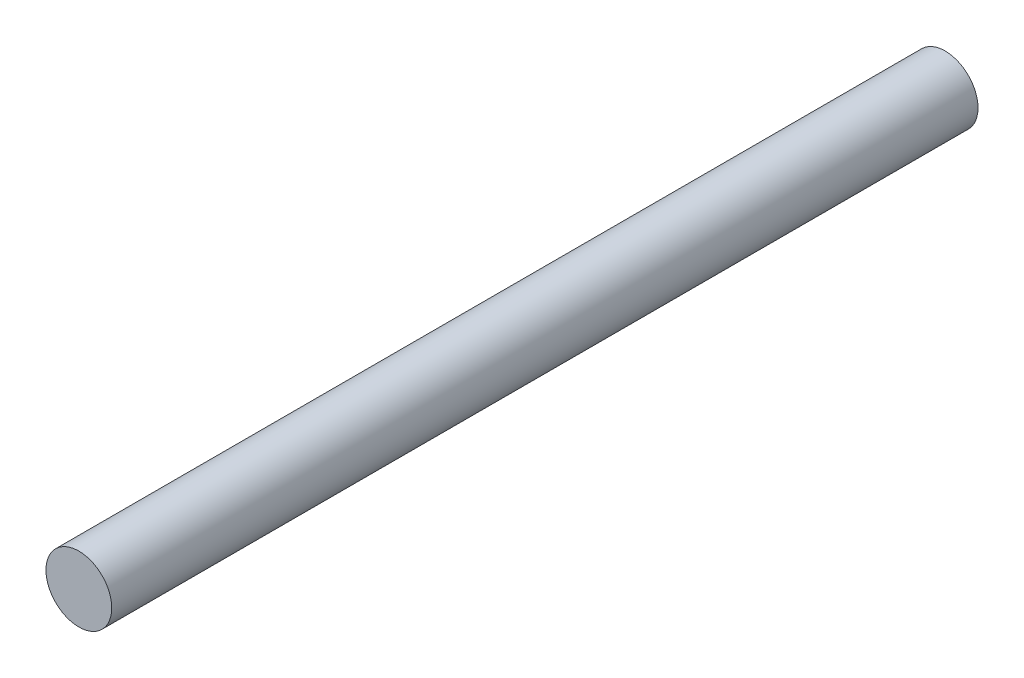
ISO-10303-21;
HEADER;
FILE_DESCRIPTION(('STEP AP214'),'2;1');
FILE_NAME('part.step','',(''),(''),'','','');
FILE_SCHEMA(('AUTOMOTIVE_DESIGN { 1 0 10303 214 1 1 1 1 }'));
ENDSEC;
DATA;
#1=APPLICATION_CONTEXT('core data for automotive mechanical design processes');
#2=APPLICATION_PROTOCOL_DEFINITION('international standard','automotive_design',2000,#1);
#3=PRODUCT_CONTEXT('',#1,'mechanical');
#4=PRODUCT('Part','Part','',(#3));
#5=PRODUCT_RELATED_PRODUCT_CATEGORY('part','',(#4));
#6=PRODUCT_DEFINITION_FORMATION('','',#4);
#7=PRODUCT_DEFINITION_CONTEXT('part definition',#1,'design');
#8=PRODUCT_DEFINITION('design','',#6,#7);
#9=PRODUCT_DEFINITION_SHAPE('','',#8);
#10=(LENGTH_UNIT() NAMED_UNIT(*) SI_UNIT(.MILLI.,.METRE.));
#11=(NAMED_UNIT(*) PLANE_ANGLE_UNIT() SI_UNIT($,.RADIAN.));
#12=(NAMED_UNIT(*) SI_UNIT($,.STERADIAN.) SOLID_ANGLE_UNIT());
#13=UNCERTAINTY_MEASURE_WITH_UNIT(LENGTH_MEASURE(1.E-05),#10,'distance_accuracy_value','');
#14=(GEOMETRIC_REPRESENTATION_CONTEXT(3) GLOBAL_UNCERTAINTY_ASSIGNED_CONTEXT((#13)) GLOBAL_UNIT_ASSIGNED_CONTEXT((#10,
#11,#12)) REPRESENTATION_CONTEXT('',''));
#15=CARTESIAN_POINT('',(0.,0.,0.));
#16=DIRECTION('',(0.,0.,1.));
#17=DIRECTION('',(1.,0.,0.));
#18=AXIS2_PLACEMENT_3D('',#15,#16,#17);
#19=CARTESIAN_POINT('',(0.,0.,158.));
#20=DIRECTION('',(0.,0.,-1.));
#21=DIRECTION('',(-1.,0.,0.));
#22=AXIS2_PLACEMENT_3D('',#19,#20,#21);
#23=CYLINDRICAL_SURFACE('',#22,6.);
#24=CARTESIAN_POINT('',(0.,0.,158.));
#25=DIRECTION('',(0.,0.,1.));
#26=DIRECTION('',(1.,0.,0.));
#27=AXIS2_PLACEMENT_3D('',#24,#25,#26);
#28=CIRCLE('',#27,6.);
#29=CARTESIAN_POINT('',(6.,0.,158.));
#30=VERTEX_POINT('',#29);
#31=EDGE_CURVE('E10',#30,#30,#28,.T.);
#32=ORIENTED_EDGE('',*,*,#31,.F.);
#33=EDGE_LOOP('',(#32));
#34=FACE_BOUND('',#33,.T.);
#35=CARTESIAN_POINT('',(0.,0.,0.));
#36=DIRECTION('',(0.,0.,1.));
#37=DIRECTION('',(1.,0.,0.));
#38=AXIS2_PLACEMENT_3D('',#35,#36,#37);
#39=CIRCLE('',#38,6.);
#40=CARTESIAN_POINT('',(6.,0.,0.));
#41=VERTEX_POINT('',#40);
#42=EDGE_CURVE('E34',#41,#41,#39,.T.);
#43=ORIENTED_EDGE('',*,*,#42,.T.);
#44=EDGE_LOOP('',(#43));
#45=FACE_BOUND('',#44,.T.);
#46=ADVANCED_FACE('F31',(#34,#45),#23,.T.);
#47=CARTESIAN_POINT('',(0.,0.,158.));
#48=DIRECTION('',(0.,0.,1.));
#49=DIRECTION('',(1.,0.,0.));
#50=AXIS2_PLACEMENT_3D('',#47,#48,#49);
#51=PLANE('',#50);
#52=ORIENTED_EDGE('',*,*,#31,.T.);
#53=EDGE_LOOP('',(#52));
#54=FACE_BOUND('',#53,.T.);
#55=ADVANCED_FACE('F46',(#54),#51,.T.);
#56=CARTESIAN_POINT('',(0.,0.,0.));
#57=DIRECTION('',(0.,0.,1.));
#58=DIRECTION('',(1.,0.,0.));
#59=AXIS2_PLACEMENT_3D('',#56,#57,#58);
#60=PLANE('',#59);
#61=ORIENTED_EDGE('',*,*,#42,.F.);
#62=EDGE_LOOP('',(#61));
#63=FACE_BOUND('',#62,.T.);
#64=ADVANCED_FACE('F44',(#63),#60,.F.);
#65=CLOSED_SHELL('',(#46,#55,#64));
#66=MANIFOLD_SOLID_BREP('B2',#65);
#67=ADVANCED_BREP_SHAPE_REPRESENTATION('',(#18,#66),#14);
#68=SHAPE_DEFINITION_REPRESENTATION(#9,#67);
ENDSEC;
END-ISO-10303-21;
